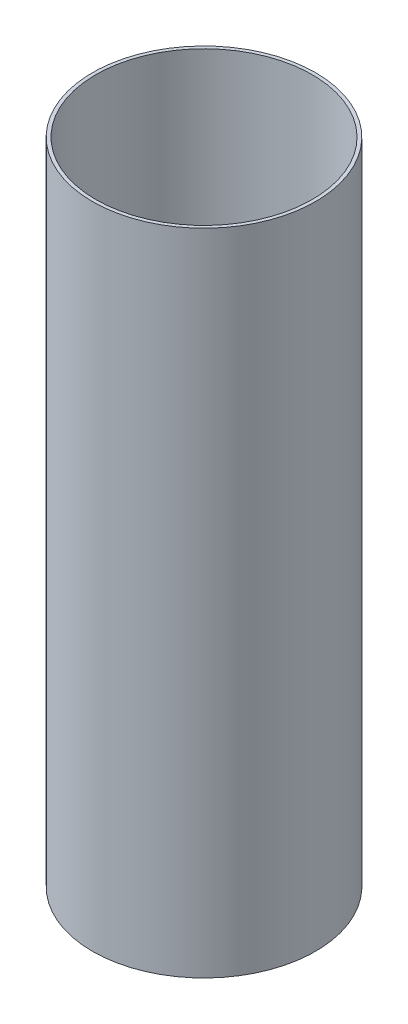
ISO-10303-21;
HEADER;
FILE_DESCRIPTION(('STEP AP214'),'2;1');
FILE_NAME('part.step','',(''),(''),'','','');
FILE_SCHEMA(('AUTOMOTIVE_DESIGN { 1 0 10303 214 1 1 1 1 }'));
ENDSEC;
DATA;
#1=APPLICATION_CONTEXT('core data for automotive mechanical design processes');
#2=APPLICATION_PROTOCOL_DEFINITION('international standard','automotive_design',2000,#1);
#3=PRODUCT_CONTEXT('',#1,'mechanical');
#4=PRODUCT('Part','Part','',(#3));
#5=PRODUCT_RELATED_PRODUCT_CATEGORY('part','',(#4));
#6=PRODUCT_DEFINITION_FORMATION('','',#4);
#7=PRODUCT_DEFINITION_CONTEXT('part definition',#1,'design');
#8=PRODUCT_DEFINITION('design','',#6,#7);
#9=PRODUCT_DEFINITION_SHAPE('','',#8);
#10=(LENGTH_UNIT() NAMED_UNIT(*) SI_UNIT(.MILLI.,.METRE.));
#11=(NAMED_UNIT(*) PLANE_ANGLE_UNIT() SI_UNIT($,.RADIAN.));
#12=(NAMED_UNIT(*) SI_UNIT($,.STERADIAN.) SOLID_ANGLE_UNIT());
#13=UNCERTAINTY_MEASURE_WITH_UNIT(LENGTH_MEASURE(1.E-05),#10,'distance_accuracy_value','');
#14=(GEOMETRIC_REPRESENTATION_CONTEXT(3) GLOBAL_UNCERTAINTY_ASSIGNED_CONTEXT((#13)) GLOBAL_UNIT_ASSIGNED_CONTEXT((#10,
#11,#12)) REPRESENTATION_CONTEXT('',''));
#15=CARTESIAN_POINT('',(0.,0.,0.));
#16=DIRECTION('',(0.,0.,1.));
#17=DIRECTION('',(1.,0.,0.));
#18=AXIS2_PLACEMENT_3D('',#15,#16,#17);
#19=CARTESIAN_POINT('',(0.,609.6,0.));
#20=DIRECTION('',(0.,1.,0.));
#21=DIRECTION('',(0.,0.,1.));
#22=AXIS2_PLACEMENT_3D('',#19,#20,#21);
#23=PLANE('',#22);
#24=CARTESIAN_POINT('',(0.,609.6,0.));
#25=DIRECTION('',(0.,1.,0.));
#26=DIRECTION('',(0.,0.,1.));
#27=AXIS2_PLACEMENT_3D('',#24,#25,#26);
#28=CIRCLE('',#27,104.775);
#29=CARTESIAN_POINT('',(0.,609.6,104.775));
#30=VERTEX_POINT('',#29);
#31=EDGE_CURVE('E10',#30,#30,#28,.T.);
#32=ORIENTED_EDGE('',*,*,#31,.T.);
#33=EDGE_LOOP('',(#32));
#34=FACE_BOUND('',#33,.T.);
#35=CARTESIAN_POINT('',(0.,609.6,0.));
#36=DIRECTION('',(0.,1.,0.));
#37=DIRECTION('',(0.,0.,1.));
#38=AXIS2_PLACEMENT_3D('',#35,#36,#37);
#39=CIRCLE('',#38,101.6);
#40=CARTESIAN_POINT('',(0.,609.6,101.6));
#41=VERTEX_POINT('',#40);
#42=EDGE_CURVE('E42',#41,#41,#39,.T.);
#43=ORIENTED_EDGE('',*,*,#42,.F.);
#44=EDGE_LOOP('',(#43));
#45=FACE_BOUND('',#44,.T.);
#46=ADVANCED_FACE('F31',(#34,#45),#23,.T.);
#47=CARTESIAN_POINT('',(0.,0.,0.));
#48=DIRECTION('',(0.,1.,0.));
#49=DIRECTION('',(0.,0.,1.));
#50=AXIS2_PLACEMENT_3D('',#47,#48,#49);
#51=PLANE('',#50);
#52=CARTESIAN_POINT('',(0.,0.,0.));
#53=DIRECTION('',(0.,1.,0.));
#54=DIRECTION('',(0.,0.,1.));
#55=AXIS2_PLACEMENT_3D('',#52,#53,#54);
#56=CIRCLE('',#55,104.775);
#57=CARTESIAN_POINT('',(0.,0.,104.775));
#58=VERTEX_POINT('',#57);
#59=EDGE_CURVE('E35',#58,#58,#56,.T.);
#60=ORIENTED_EDGE('',*,*,#59,.F.);
#61=EDGE_LOOP('',(#60));
#62=FACE_BOUND('',#61,.T.);
#63=CARTESIAN_POINT('',(0.,0.,0.));
#64=DIRECTION('',(0.,1.,0.));
#65=DIRECTION('',(0.,0.,1.));
#66=AXIS2_PLACEMENT_3D('',#63,#64,#65);
#67=CIRCLE('',#66,101.6);
#68=CARTESIAN_POINT('',(0.,0.,101.6));
#69=VERTEX_POINT('',#68);
#70=EDGE_CURVE('E44',#69,#69,#67,.T.);
#71=ORIENTED_EDGE('',*,*,#70,.T.);
#72=EDGE_LOOP('',(#71));
#73=FACE_BOUND('',#72,.T.);
#74=ADVANCED_FACE('F54',(#62,#73),#51,.F.);
#75=CARTESIAN_POINT('',(0.,609.6,0.));
#76=DIRECTION('',(0.,-1.,0.));
#77=DIRECTION('',(0.,0.,-1.));
#78=AXIS2_PLACEMENT_3D('',#75,#76,#77);
#79=CYLINDRICAL_SURFACE('',#78,104.775);
#80=ORIENTED_EDGE('',*,*,#31,.F.);
#81=EDGE_LOOP('',(#80));
#82=FACE_BOUND('',#81,.T.);
#83=ORIENTED_EDGE('',*,*,#59,.T.);
#84=EDGE_LOOP('',(#83));
#85=FACE_BOUND('',#84,.T.);
#86=ADVANCED_FACE('F33',(#82,#85),#79,.T.);
#87=CARTESIAN_POINT('',(0.,609.6,0.));
#88=DIRECTION('',(0.,-1.,0.));
#89=DIRECTION('',(0.,0.,-1.));
#90=AXIS2_PLACEMENT_3D('',#87,#88,#89);
#91=CYLINDRICAL_SURFACE('',#90,101.6);
#92=ORIENTED_EDGE('',*,*,#42,.T.);
#93=EDGE_LOOP('',(#92));
#94=FACE_BOUND('',#93,.T.);
#95=ORIENTED_EDGE('',*,*,#70,.F.);
#96=EDGE_LOOP('',(#95));
#97=FACE_BOUND('',#96,.T.);
#98=ADVANCED_FACE('F50',(#94,#97),#91,.F.);
#99=CLOSED_SHELL('',(#46,#74,#86,#98));
#100=MANIFOLD_SOLID_BREP('B2',#99);
#101=ADVANCED_BREP_SHAPE_REPRESENTATION('',(#18,#100),#14);
#102=SHAPE_DEFINITION_REPRESENTATION(#9,#101);
ENDSEC;
END-ISO-10303-21;
